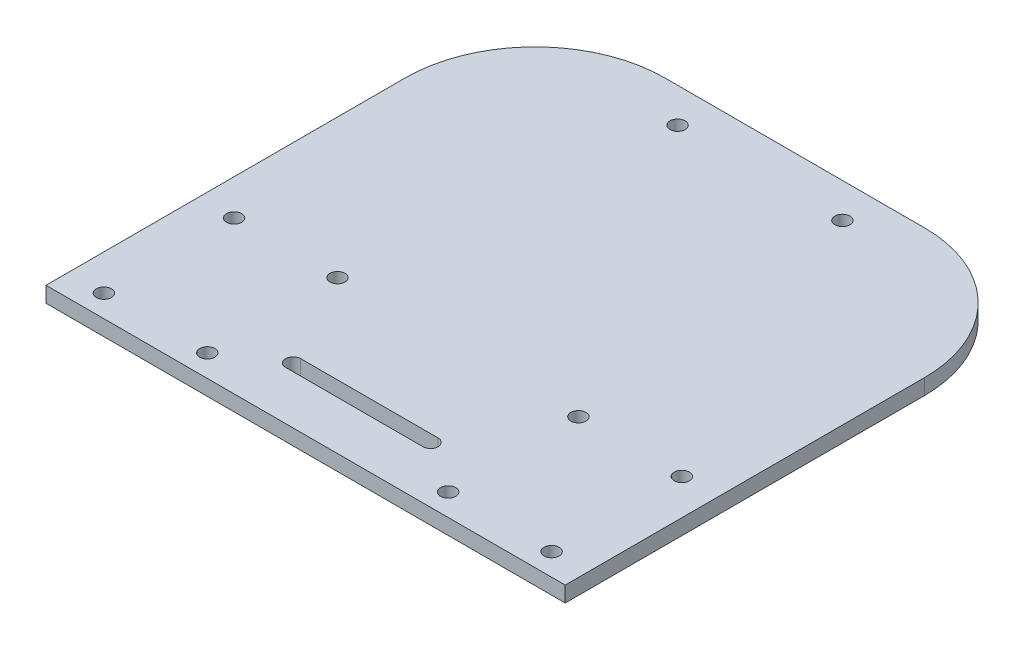
ISO-10303-21;
HEADER;
FILE_DESCRIPTION(('STEP AP214'),'2;1');
FILE_NAME('part.step','',(''),(''),'','','');
FILE_SCHEMA(('AUTOMOTIVE_DESIGN { 1 0 10303 214 1 1 1 1 }'));
ENDSEC;
DATA;
#1=APPLICATION_CONTEXT('core data for automotive mechanical design processes');
#2=APPLICATION_PROTOCOL_DEFINITION('international standard','automotive_design',2000,#1);
#3=PRODUCT_CONTEXT('',#1,'mechanical');
#4=PRODUCT('Part','Part','',(#3));
#5=PRODUCT_RELATED_PRODUCT_CATEGORY('part','',(#4));
#6=PRODUCT_DEFINITION_FORMATION('','',#4);
#7=PRODUCT_DEFINITION_CONTEXT('part definition',#1,'design');
#8=PRODUCT_DEFINITION('design','',#6,#7);
#9=PRODUCT_DEFINITION_SHAPE('','',#8);
#10=(LENGTH_UNIT() NAMED_UNIT(*) SI_UNIT(.MILLI.,.METRE.));
#11=(NAMED_UNIT(*) PLANE_ANGLE_UNIT() SI_UNIT($,.RADIAN.));
#12=(NAMED_UNIT(*) SI_UNIT($,.STERADIAN.) SOLID_ANGLE_UNIT());
#13=UNCERTAINTY_MEASURE_WITH_UNIT(LENGTH_MEASURE(1.E-05),#10,'distance_accuracy_value','');
#14=(GEOMETRIC_REPRESENTATION_CONTEXT(3) GLOBAL_UNCERTAINTY_ASSIGNED_CONTEXT((#13)) GLOBAL_UNIT_ASSIGNED_CONTEXT((#10,
#11,#12)) REPRESENTATION_CONTEXT('',''));
#15=CARTESIAN_POINT('',(0.,0.,0.));
#16=DIRECTION('',(0.,0.,1.));
#17=DIRECTION('',(1.,0.,0.));
#18=AXIS2_PLACEMENT_3D('',#15,#16,#17);
#19=CARTESIAN_POINT('',(125.000000000001,3.6,-110.));
#20=DIRECTION('',(0.,-1.,0.));
#21=DIRECTION('',(0.,0.,-1.));
#22=AXIS2_PLACEMENT_3D('',#19,#20,#21);
#23=CYLINDRICAL_SURFACE('',#22,30.);
#24=DIRECTION('',(0.,-1.,0.));
#25=VECTOR('',#24,1.);
#26=CARTESIAN_POINT('',(125.000000000001,3.6,-140.));
#27=LINE('',#26,#25);
#28=CARTESIAN_POINT('',(125.000000000001,3.6,-140.));
#29=VERTEX_POINT('',#28);
#30=CARTESIAN_POINT('',(125.000000000001,0.,-140.));
#31=VERTEX_POINT('',#30);
#32=EDGE_CURVE('E245',#29,#31,#27,.T.);
#33=ORIENTED_EDGE('',*,*,#32,.F.);
#34=CARTESIAN_POINT('',(125.000000000001,3.6,-110.));
#35=DIRECTION('',(0.,1.,0.));
#36=DIRECTION('',(0.,0.,1.));
#37=AXIS2_PLACEMENT_3D('',#34,#35,#36);
#38=CIRCLE('',#37,30.);
#39=CARTESIAN_POINT('',(155.000000000001,3.6,-110.000000000001));
#40=VERTEX_POINT('',#39);
#41=EDGE_CURVE('E42',#40,#29,#38,.T.);
#42=ORIENTED_EDGE('',*,*,#41,.F.);
#43=DIRECTION('',(0.,-1.,0.));
#44=VECTOR('',#43,1.);
#45=CARTESIAN_POINT('',(155.000000000001,3.6,-110.000000000001));
#46=LINE('',#45,#44);
#47=CARTESIAN_POINT('',(155.000000000001,0.,-110.000000000001));
#48=VERTEX_POINT('',#47);
#49=EDGE_CURVE('E248',#48,#40,#46,.F.);
#50=ORIENTED_EDGE('',*,*,#49,.F.);
#51=CARTESIAN_POINT('',(125.000000000001,0.,-110.));
#52=DIRECTION('',(0.,1.,0.));
#53=DIRECTION('',(0.,0.,1.));
#54=AXIS2_PLACEMENT_3D('',#51,#52,#53);
#55=CIRCLE('',#54,30.);
#56=EDGE_CURVE('E11',#31,#48,#55,.F.);
#57=ORIENTED_EDGE('',*,*,#56,.F.);
#58=EDGE_LOOP('',(#33,#42,#50,#57));
#59=FACE_BOUND('',#58,.T.);
#60=ADVANCED_FACE('F35',(#59),#23,.T.);
#61=CARTESIAN_POINT('',(65.0000000000009,3.6,-110.));
#62=DIRECTION('',(0.,1.,0.));
#63=DIRECTION('',(0.,0.,1.));
#64=AXIS2_PLACEMENT_3D('',#61,#62,#63);
#65=CYLINDRICAL_SURFACE('',#64,30.);
#66=DIRECTION('',(0.,-1.,0.));
#67=VECTOR('',#66,1.);
#68=CARTESIAN_POINT('',(35.0000000000009,3.6,-109.999999999999));
#69=LINE('',#68,#67);
#70=CARTESIAN_POINT('',(35.0000000000009,3.6,-109.999999999999));
#71=VERTEX_POINT('',#70);
#72=CARTESIAN_POINT('',(35.0000000000009,0.,-109.999999999999));
#73=VERTEX_POINT('',#72);
#74=EDGE_CURVE('E231',#71,#73,#69,.T.);
#75=ORIENTED_EDGE('',*,*,#74,.F.);
#76=CARTESIAN_POINT('',(65.0000000000009,3.6,-110.));
#77=DIRECTION('',(0.,1.,0.));
#78=DIRECTION('',(0.,0.,1.));
#79=AXIS2_PLACEMENT_3D('',#76,#77,#78);
#80=CIRCLE('',#79,30.);
#81=CARTESIAN_POINT('',(65.0000000000009,3.6,-140.));
#82=VERTEX_POINT('',#81);
#83=EDGE_CURVE('E241',#82,#71,#80,.T.);
#84=ORIENTED_EDGE('',*,*,#83,.F.);
#85=DIRECTION('',(0.,-1.,0.));
#86=VECTOR('',#85,1.);
#87=CARTESIAN_POINT('',(65.0000000000009,3.6,-140.));
#88=LINE('',#87,#86);
#89=CARTESIAN_POINT('',(65.0000000000009,0.,-140.));
#90=VERTEX_POINT('',#89);
#91=EDGE_CURVE('E238',#90,#82,#88,.F.);
#92=ORIENTED_EDGE('',*,*,#91,.F.);
#93=CARTESIAN_POINT('',(65.0000000000009,0.,-110.));
#94=DIRECTION('',(0.,1.,0.));
#95=DIRECTION('',(0.,0.,1.));
#96=AXIS2_PLACEMENT_3D('',#93,#94,#95);
#97=CIRCLE('',#96,30.);
#98=EDGE_CURVE('E243',#73,#90,#97,.F.);
#99=ORIENTED_EDGE('',*,*,#98,.F.);
#100=EDGE_LOOP('',(#75,#84,#92,#99));
#101=FACE_BOUND('',#100,.T.);
#102=ADVANCED_FACE('F258',(#101),#65,.T.);
#103=CARTESIAN_POINT('',(35.0000000000043,3.6,-1.07444342852169E-12));
#104=DIRECTION('',(1.,0.,0.));
#105=DIRECTION('',(0.,0.,-1.));
#106=AXIS2_PLACEMENT_3D('',#103,#104,#105);
#107=PLANE('',#106);
#108=DIRECTION('',(0.,0.,1.));
#109=VECTOR('',#108,1.);
#110=CARTESIAN_POINT('',(35.0000000000043,3.6,-1.07444342852169E-12));
#111=LINE('',#110,#109);
#112=CARTESIAN_POINT('',(35.0000000000034,3.6,-26.9827483746946));
#113=VERTEX_POINT('',#112);
#114=EDGE_CURVE('E140',#71,#113,#111,.T.);
#115=ORIENTED_EDGE('',*,*,#114,.F.);
#116=ORIENTED_EDGE('',*,*,#74,.T.);
#117=DIRECTION('',(0.,0.,1.));
#118=VECTOR('',#117,1.);
#119=CARTESIAN_POINT('',(35.0000000000043,0.,-1.07444342852169E-12));
#120=LINE('',#119,#118);
#121=CARTESIAN_POINT('',(35.0000000000034,0.,-26.9827483746946));
#122=VERTEX_POINT('',#121);
#123=EDGE_CURVE('E190',#73,#122,#120,.T.);
#124=ORIENTED_EDGE('',*,*,#123,.T.);
#125=DIRECTION('',(0.,-1.,0.));
#126=VECTOR('',#125,1.);
#127=CARTESIAN_POINT('',(35.0000000000034,3.6,-26.9827483746946));
#128=LINE('',#127,#126);
#129=EDGE_CURVE('E228',#113,#122,#128,.T.);
#130=ORIENTED_EDGE('',*,*,#129,.F.);
#131=EDGE_LOOP('',(#115,#116,#124,#130));
#132=FACE_BOUND('',#131,.T.);
#133=ADVANCED_FACE('F266',(#132),#107,.F.);
#134=CARTESIAN_POINT('',(0.,3.6,-26.9827483746946));
#135=DIRECTION('',(0.,0.,-1.));
#136=DIRECTION('',(-1.,0.,0.));
#137=AXIS2_PLACEMENT_3D('',#134,#135,#136);
#138=PLANE('',#137);
#139=DIRECTION('',(1.,0.,0.));
#140=VECTOR('',#139,1.);
#141=CARTESIAN_POINT('',(0.,0.,-26.9827483746946));
#142=LINE('',#141,#140);
#143=CARTESIAN_POINT('',(155.000000000003,0.,-26.9827483746946));
#144=VERTEX_POINT('',#143);
#145=EDGE_CURVE('E192',#122,#144,#142,.T.);
#146=ORIENTED_EDGE('',*,*,#145,.T.);
#147=DIRECTION('',(0.,-1.,0.));
#148=VECTOR('',#147,1.);
#149=CARTESIAN_POINT('',(155.000000000003,3.6,-26.9827483746946));
#150=LINE('',#149,#148);
#151=CARTESIAN_POINT('',(155.000000000003,3.6,-26.9827483746946));
#152=VERTEX_POINT('',#151);
#153=EDGE_CURVE('E118',#152,#144,#150,.T.);
#154=ORIENTED_EDGE('',*,*,#153,.F.);
#155=DIRECTION('',(1.,0.,0.));
#156=VECTOR('',#155,1.);
#157=CARTESIAN_POINT('',(0.,3.6,-26.9827483746946));
#158=LINE('',#157,#156);
#159=EDGE_CURVE('E142',#113,#152,#158,.T.);
#160=ORIENTED_EDGE('',*,*,#159,.F.);
#161=ORIENTED_EDGE('',*,*,#129,.T.);
#162=EDGE_LOOP('',(#146,#154,#160,#161));
#163=FACE_BOUND('',#162,.T.);
#164=ADVANCED_FACE('F265',(#163),#138,.F.);
#165=CARTESIAN_POINT('',(155.000000000004,3.6,-4.79631546492035E-12));
#166=DIRECTION('',(1.,0.,0.));
#167=DIRECTION('',(0.,0.,-1.));
#168=AXIS2_PLACEMENT_3D('',#165,#166,#167);
#169=PLANE('',#168);
#170=DIRECTION('',(0.,0.,1.));
#171=VECTOR('',#170,1.);
#172=CARTESIAN_POINT('',(155.000000000004,0.,-4.79631546492035E-12));
#173=LINE('',#172,#171);
#174=EDGE_CURVE('E195',#48,#144,#173,.T.);
#175=ORIENTED_EDGE('',*,*,#174,.F.);
#176=ORIENTED_EDGE('',*,*,#49,.T.);
#177=DIRECTION('',(0.,0.,1.));
#178=VECTOR('',#177,1.);
#179=CARTESIAN_POINT('',(155.000000000004,3.6,-4.79631546492035E-12));
#180=LINE('',#179,#178);
#181=EDGE_CURVE('E145',#40,#152,#180,.T.);
#182=ORIENTED_EDGE('',*,*,#181,.T.);
#183=ORIENTED_EDGE('',*,*,#153,.T.);
#184=EDGE_LOOP('',(#175,#176,#182,#183));
#185=FACE_BOUND('',#184,.T.);
#186=ADVANCED_FACE('F273',(#185),#169,.T.);
#187=CARTESIAN_POINT('',(110.877455899999,3.6,-39.9827483746946));
#188=DIRECTION('',(0.,-1.,0.));
#189=DIRECTION('',(0.,0.,-1.));
#190=AXIS2_PLACEMENT_3D('',#187,#188,#189);
#191=CYLINDRICAL_SURFACE('',#190,1.75);
#192=CARTESIAN_POINT('',(110.877455899999,0.,-39.9827483746946));
#193=DIRECTION('',(0.,1.,0.));
#194=DIRECTION('',(0.,0.,1.));
#195=AXIS2_PLACEMENT_3D('',#192,#193,#194);
#196=CIRCLE('',#195,1.75);
#197=CARTESIAN_POINT('',(110.877455899999,0.,-38.2327483746946));
#198=VERTEX_POINT('',#197);
#199=CARTESIAN_POINT('',(110.877455899999,0.,-41.7327483746946));
#200=VERTEX_POINT('',#199);
#201=EDGE_CURVE('E113',#198,#200,#196,.T.);
#202=ORIENTED_EDGE('',*,*,#201,.F.);
#203=DIRECTION('',(0.,-1.,0.));
#204=VECTOR('',#203,1.);
#205=CARTESIAN_POINT('',(110.877455899999,3.6,-38.2327483746946));
#206=LINE('',#205,#204);
#207=CARTESIAN_POINT('',(110.877455899999,3.6,-38.2327483746946));
#208=VERTEX_POINT('',#207);
#209=EDGE_CURVE('E108',#208,#198,#206,.T.);
#210=ORIENTED_EDGE('',*,*,#209,.F.);
#211=CARTESIAN_POINT('',(110.877455899999,3.6,-39.9827483746946));
#212=DIRECTION('',(0.,1.,0.));
#213=DIRECTION('',(0.,0.,1.));
#214=AXIS2_PLACEMENT_3D('',#211,#212,#213);
#215=CIRCLE('',#214,1.75);
#216=CARTESIAN_POINT('',(110.877455899999,3.6,-41.7327483746946));
#217=VERTEX_POINT('',#216);
#218=EDGE_CURVE('E111',#208,#217,#215,.T.);
#219=ORIENTED_EDGE('',*,*,#218,.T.);
#220=DIRECTION('',(0.,-1.,0.));
#221=VECTOR('',#220,1.);
#222=CARTESIAN_POINT('',(110.877455899999,3.6,-41.7327483746946));
#223=LINE('',#222,#221);
#224=EDGE_CURVE('E177',#217,#200,#223,.T.);
#225=ORIENTED_EDGE('',*,*,#224,.T.);
#226=EDGE_LOOP('',(#202,#210,#219,#225));
#227=FACE_BOUND('',#226,.T.);
#228=ADVANCED_FACE('F110',(#227),#191,.F.);
#229=CARTESIAN_POINT('',(0.,3.6,-38.2327483746945));
#230=DIRECTION('',(0.,0.,-1.));
#231=DIRECTION('',(-1.,0.,0.));
#232=AXIS2_PLACEMENT_3D('',#229,#230,#231);
#233=PLANE('',#232);
#234=DIRECTION('',(1.,0.,0.));
#235=VECTOR('',#234,1.);
#236=CARTESIAN_POINT('',(0.,0.,-38.2327483746945));
#237=LINE('',#236,#235);
#238=CARTESIAN_POINT('',(79.1225441000007,0.,-38.2327483746946));
#239=VERTEX_POINT('',#238);
#240=EDGE_CURVE('E182',#239,#198,#237,.T.);
#241=ORIENTED_EDGE('',*,*,#240,.F.);
#242=DIRECTION('',(0.,-1.,0.));
#243=VECTOR('',#242,1.);
#244=CARTESIAN_POINT('',(79.1225441000007,3.6,-38.2327483746946));
#245=LINE('',#244,#243);
#246=CARTESIAN_POINT('',(79.1225441000007,3.6,-38.2327483746946));
#247=VERTEX_POINT('',#246);
#248=EDGE_CURVE('E119',#247,#239,#245,.T.);
#249=ORIENTED_EDGE('',*,*,#248,.F.);
#250=DIRECTION('',(1.,0.,0.));
#251=VECTOR('',#250,1.);
#252=CARTESIAN_POINT('',(0.,3.6,-38.2327483746945));
#253=LINE('',#252,#251);
#254=EDGE_CURVE('E126',#247,#208,#253,.T.);
#255=ORIENTED_EDGE('',*,*,#254,.T.);
#256=ORIENTED_EDGE('',*,*,#209,.T.);
#257=EDGE_LOOP('',(#241,#249,#255,#256));
#258=FACE_BOUND('',#257,.T.);
#259=ADVANCED_FACE('F133',(#258),#233,.T.);
#260=CARTESIAN_POINT('',(79.1225441000007,3.6,-39.9827483746946));
#261=DIRECTION('',(0.,-1.,0.));
#262=DIRECTION('',(0.,0.,-1.));
#263=AXIS2_PLACEMENT_3D('',#260,#261,#262);
#264=CYLINDRICAL_SURFACE('',#263,1.75);
#265=CARTESIAN_POINT('',(79.1225441000007,0.,-39.9827483746946));
#266=DIRECTION('',(0.,1.,0.));
#267=DIRECTION('',(0.,0.,1.));
#268=AXIS2_PLACEMENT_3D('',#265,#266,#267);
#269=CIRCLE('',#268,1.75);
#270=CARTESIAN_POINT('',(79.1225441000007,0.,-41.7327483746946));
#271=VERTEX_POINT('',#270);
#272=EDGE_CURVE('E184',#271,#239,#269,.T.);
#273=ORIENTED_EDGE('',*,*,#272,.F.);
#274=DIRECTION('',(0.,-1.,0.));
#275=VECTOR('',#274,1.);
#276=CARTESIAN_POINT('',(79.1225441000007,3.6,-41.7327483746946));
#277=LINE('',#276,#275);
#278=CARTESIAN_POINT('',(79.1225441000007,3.6,-41.7327483746946));
#279=VERTEX_POINT('',#278);
#280=EDGE_CURVE('E233',#279,#271,#277,.T.);
#281=ORIENTED_EDGE('',*,*,#280,.F.);
#282=CARTESIAN_POINT('',(79.1225441000007,3.6,-39.9827483746946));
#283=DIRECTION('',(0.,1.,0.));
#284=DIRECTION('',(0.,0.,1.));
#285=AXIS2_PLACEMENT_3D('',#282,#283,#284);
#286=CIRCLE('',#285,1.75);
#287=EDGE_CURVE('E134',#279,#247,#286,.T.);
#288=ORIENTED_EDGE('',*,*,#287,.T.);
#289=ORIENTED_EDGE('',*,*,#248,.T.);
#290=EDGE_LOOP('',(#273,#281,#288,#289));
#291=FACE_BOUND('',#290,.T.);
#292=ADVANCED_FACE('F300',(#291),#264,.F.);
#293=CARTESIAN_POINT('',(67.1630650365044,3.6,-62.1932949656054));
#294=DIRECTION('',(0.,-1.,0.));
#295=DIRECTION('',(0.,0.,-1.));
#296=AXIS2_PLACEMENT_3D('',#293,#294,#295);
#297=CYLINDRICAL_SURFACE('',#296,1.75);
#298=CARTESIAN_POINT('',(67.1630650365044,3.6,-62.1932949656054));
#299=DIRECTION('',(0.,1.,0.));
#300=DIRECTION('',(0.,0.,1.));
#301=AXIS2_PLACEMENT_3D('',#298,#299,#300);
#302=CIRCLE('',#301,1.75);
#303=CARTESIAN_POINT('',(67.1630650365044,3.6,-60.4432949656054));
#304=VERTEX_POINT('',#303);
#305=EDGE_CURVE('E171',#304,#304,#302,.T.);
#306=ORIENTED_EDGE('',*,*,#305,.T.);
#307=EDGE_LOOP('',(#306));
#308=FACE_BOUND('',#307,.T.);
#309=CARTESIAN_POINT('',(67.1630650365044,0.,-62.1932949656054));
#310=DIRECTION('',(0.,1.,0.));
#311=DIRECTION('',(0.,0.,1.));
#312=AXIS2_PLACEMENT_3D('',#309,#310,#311);
#313=CIRCLE('',#312,1.75);
#314=CARTESIAN_POINT('',(67.1630650365044,0.,-60.4432949656054));
#315=VERTEX_POINT('',#314);
#316=EDGE_CURVE('E220',#315,#315,#313,.T.);
#317=ORIENTED_EDGE('',*,*,#316,.F.);
#318=EDGE_LOOP('',(#317));
#319=FACE_BOUND('',#318,.T.);
#320=ADVANCED_FACE('F303',(#308,#319),#297,.F.);
#321=CARTESIAN_POINT('',(43.2630650365112,3.6,-62.1932949656054));
#322=DIRECTION('',(0.,-1.,0.));
#323=DIRECTION('',(0.,0.,-1.));
#324=AXIS2_PLACEMENT_3D('',#321,#322,#323);
#325=CYLINDRICAL_SURFACE('',#324,1.75);
#326=CARTESIAN_POINT('',(43.2630650365112,3.6,-62.1932949656054));
#327=DIRECTION('',(0.,1.,0.));
#328=DIRECTION('',(0.,0.,1.));
#329=AXIS2_PLACEMENT_3D('',#326,#327,#328);
#330=CIRCLE('',#329,1.75);
#331=CARTESIAN_POINT('',(43.2630650365112,3.6,-60.4432949656054));
#332=VERTEX_POINT('',#331);
#333=EDGE_CURVE('E168',#332,#332,#330,.T.);
#334=ORIENTED_EDGE('',*,*,#333,.T.);
#335=EDGE_LOOP('',(#334));
#336=FACE_BOUND('',#335,.T.);
#337=CARTESIAN_POINT('',(43.2630650365112,0.,-62.1932949656054));
#338=DIRECTION('',(0.,1.,0.));
#339=DIRECTION('',(0.,0.,1.));
#340=AXIS2_PLACEMENT_3D('',#337,#338,#339);
#341=CIRCLE('',#340,1.75);
#342=CARTESIAN_POINT('',(43.2630650365112,0.,-60.4432949656054));
#343=VERTEX_POINT('',#342);
#344=EDGE_CURVE('E217',#343,#343,#341,.T.);
#345=ORIENTED_EDGE('',*,*,#344,.F.);
#346=EDGE_LOOP('',(#345));
#347=FACE_BOUND('',#346,.T.);
#348=ADVANCED_FACE('F329',(#336,#347),#325,.F.);
#349=CARTESIAN_POINT('',(67.1630650365044,3.6,-32.0932949656049));
#350=DIRECTION('',(0.,-1.,0.));
#351=DIRECTION('',(0.,0.,-1.));
#352=AXIS2_PLACEMENT_3D('',#349,#350,#351);
#353=CYLINDRICAL_SURFACE('',#352,1.75);
#354=CARTESIAN_POINT('',(67.1630650365044,3.6,-32.0932949656049));
#355=DIRECTION('',(0.,1.,0.));
#356=DIRECTION('',(0.,0.,1.));
#357=AXIS2_PLACEMENT_3D('',#354,#355,#356);
#358=CIRCLE('',#357,1.75);
#359=CARTESIAN_POINT('',(67.1630650365044,3.6,-30.3432949656049));
#360=VERTEX_POINT('',#359);
#361=EDGE_CURVE('E165',#360,#360,#358,.F.);
#362=ORIENTED_EDGE('',*,*,#361,.F.);
#363=EDGE_LOOP('',(#362));
#364=FACE_BOUND('',#363,.T.);
#365=CARTESIAN_POINT('',(67.1630650365044,0.,-32.0932949656049));
#366=DIRECTION('',(0.,1.,0.));
#367=DIRECTION('',(0.,0.,1.));
#368=AXIS2_PLACEMENT_3D('',#365,#366,#367);
#369=CIRCLE('',#368,1.75);
#370=CARTESIAN_POINT('',(67.1630650365044,0.,-30.3432949656049));
#371=VERTEX_POINT('',#370);
#372=EDGE_CURVE('E214',#371,#371,#369,.F.);
#373=ORIENTED_EDGE('',*,*,#372,.T.);
#374=EDGE_LOOP('',(#373));
#375=FACE_BOUND('',#374,.T.);
#376=ADVANCED_FACE('F333',(#364,#375),#353,.F.);
#377=CARTESIAN_POINT('',(122.836934963496,3.6,-62.1932949656056));
#378=DIRECTION('',(0.,-1.,0.));
#379=DIRECTION('',(0.,0.,-1.));
#380=AXIS2_PLACEMENT_3D('',#377,#378,#379);
#381=CYLINDRICAL_SURFACE('',#380,1.75000000000001);
#382=CARTESIAN_POINT('',(122.836934963496,3.6,-62.1932949656056));
#383=DIRECTION('',(0.,1.,0.));
#384=DIRECTION('',(0.,0.,1.));
#385=AXIS2_PLACEMENT_3D('',#382,#383,#384);
#386=CIRCLE('',#385,1.75000000000001);
#387=CARTESIAN_POINT('',(122.836934963496,3.6,-60.4432949656056));
#388=VERTEX_POINT('',#387);
#389=EDGE_CURVE('E162',#388,#388,#386,.F.);
#390=ORIENTED_EDGE('',*,*,#389,.F.);
#391=EDGE_LOOP('',(#390));
#392=FACE_BOUND('',#391,.T.);
#393=CARTESIAN_POINT('',(122.836934963496,0.,-62.1932949656056));
#394=DIRECTION('',(0.,1.,0.));
#395=DIRECTION('',(0.,0.,1.));
#396=AXIS2_PLACEMENT_3D('',#393,#394,#395);
#397=CIRCLE('',#396,1.75000000000001);
#398=CARTESIAN_POINT('',(122.836934963496,0.,-60.4432949656056));
#399=VERTEX_POINT('',#398);
#400=EDGE_CURVE('E211',#399,#399,#397,.F.);
#401=ORIENTED_EDGE('',*,*,#400,.T.);
#402=EDGE_LOOP('',(#401));
#403=FACE_BOUND('',#402,.T.);
#404=ADVANCED_FACE('F337',(#392,#403),#381,.F.);
#405=CARTESIAN_POINT('',(122.836934963496,3.6,-32.0932949656051));
#406=DIRECTION('',(0.,-1.,0.));
#407=DIRECTION('',(0.,0.,-1.));
#408=AXIS2_PLACEMENT_3D('',#405,#406,#407);
#409=CYLINDRICAL_SURFACE('',#408,1.74999999999998);
#410=CARTESIAN_POINT('',(122.836934963496,3.6,-32.0932949656051));
#411=DIRECTION('',(0.,1.,0.));
#412=DIRECTION('',(0.,0.,1.));
#413=AXIS2_PLACEMENT_3D('',#410,#411,#412);
#414=CIRCLE('',#413,1.74999999999998);
#415=CARTESIAN_POINT('',(122.836934963496,3.6,-30.3432949656051));
#416=VERTEX_POINT('',#415);
#417=EDGE_CURVE('E159',#416,#416,#414,.T.);
#418=ORIENTED_EDGE('',*,*,#417,.T.);
#419=EDGE_LOOP('',(#418));
#420=FACE_BOUND('',#419,.T.);
#421=CARTESIAN_POINT('',(122.836934963496,0.,-32.0932949656051));
#422=DIRECTION('',(0.,1.,0.));
#423=DIRECTION('',(0.,0.,1.));
#424=AXIS2_PLACEMENT_3D('',#421,#422,#423);
#425=CIRCLE('',#424,1.74999999999998);
#426=CARTESIAN_POINT('',(122.836934963496,0.,-30.3432949656051));
#427=VERTEX_POINT('',#426);
#428=EDGE_CURVE('E208',#427,#427,#425,.T.);
#429=ORIENTED_EDGE('',*,*,#428,.F.);
#430=EDGE_LOOP('',(#429));
#431=FACE_BOUND('',#430,.T.);
#432=ADVANCED_FACE('F341',(#420,#431),#409,.F.);
#433=CARTESIAN_POINT('',(146.736934963496,3.6,-32.0932949656055));
#434=DIRECTION('',(0.,-1.,0.));
#435=DIRECTION('',(0.,0.,-1.));
#436=AXIS2_PLACEMENT_3D('',#433,#434,#435);
#437=CYLINDRICAL_SURFACE('',#436,1.75000000000001);
#438=CARTESIAN_POINT('',(146.736934963496,3.6,-32.0932949656055));
#439=DIRECTION('',(0.,1.,0.));
#440=DIRECTION('',(0.,0.,1.));
#441=AXIS2_PLACEMENT_3D('',#438,#439,#440);
#442=CIRCLE('',#441,1.75000000000001);
#443=CARTESIAN_POINT('',(146.736934963496,3.6,-30.3432949656054));
#444=VERTEX_POINT('',#443);
#445=EDGE_CURVE('E156',#444,#444,#442,.T.);
#446=ORIENTED_EDGE('',*,*,#445,.T.);
#447=EDGE_LOOP('',(#446));
#448=FACE_BOUND('',#447,.T.);
#449=CARTESIAN_POINT('',(146.736934963496,0.,-32.0932949656055));
#450=DIRECTION('',(0.,1.,0.));
#451=DIRECTION('',(0.,0.,1.));
#452=AXIS2_PLACEMENT_3D('',#449,#450,#451);
#453=CIRCLE('',#452,1.75000000000001);
#454=CARTESIAN_POINT('',(146.736934963496,0.,-30.3432949656054));
#455=VERTEX_POINT('',#454);
#456=EDGE_CURVE('E205',#455,#455,#453,.T.);
#457=ORIENTED_EDGE('',*,*,#456,.F.);
#458=EDGE_LOOP('',(#457));
#459=FACE_BOUND('',#458,.T.);
#460=ADVANCED_FACE('F345',(#448,#459),#437,.F.);
#461=CARTESIAN_POINT('',(146.736934963489,3.6,-62.1932949656058));
#462=DIRECTION('',(0.,-1.,0.));
#463=DIRECTION('',(0.,0.,-1.));
#464=AXIS2_PLACEMENT_3D('',#461,#462,#463);
#465=CYLINDRICAL_SURFACE('',#464,1.74999999999998);
#466=CARTESIAN_POINT('',(146.736934963489,3.6,-62.1932949656058));
#467=DIRECTION('',(0.,1.,0.));
#468=DIRECTION('',(0.,0.,1.));
#469=AXIS2_PLACEMENT_3D('',#466,#467,#468);
#470=CIRCLE('',#469,1.74999999999998);
#471=CARTESIAN_POINT('',(146.736934963489,3.6,-60.4432949656059));
#472=VERTEX_POINT('',#471);
#473=EDGE_CURVE('E153',#472,#472,#470,.F.);
#474=ORIENTED_EDGE('',*,*,#473,.F.);
#475=EDGE_LOOP('',(#474));
#476=FACE_BOUND('',#475,.T.);
#477=CARTESIAN_POINT('',(146.736934963489,0.,-62.1932949656058));
#478=DIRECTION('',(0.,1.,0.));
#479=DIRECTION('',(0.,0.,1.));
#480=AXIS2_PLACEMENT_3D('',#477,#478,#479);
#481=CIRCLE('',#480,1.74999999999998);
#482=CARTESIAN_POINT('',(146.736934963489,0.,-60.4432949656059));
#483=VERTEX_POINT('',#482);
#484=EDGE_CURVE('E202',#483,#483,#481,.F.);
#485=ORIENTED_EDGE('',*,*,#484,.T.);
#486=EDGE_LOOP('',(#485));
#487=FACE_BOUND('',#486,.T.);
#488=ADVANCED_FACE('F349',(#476,#487),#465,.F.);
#489=CARTESIAN_POINT('',(75.9500000000001,3.6,-132.));
#490=DIRECTION('',(0.,-1.,0.));
#491=DIRECTION('',(0.,0.,-1.));
#492=AXIS2_PLACEMENT_3D('',#489,#490,#491);
#493=CYLINDRICAL_SURFACE('',#492,1.75);
#494=CARTESIAN_POINT('',(75.9500000000001,3.6,-132.));
#495=DIRECTION('',(0.,1.,0.));
#496=DIRECTION('',(0.,0.,1.));
#497=AXIS2_PLACEMENT_3D('',#494,#495,#496);
#498=CIRCLE('',#497,1.75);
#499=CARTESIAN_POINT('',(75.9500000000001,3.6,-130.25));
#500=VERTEX_POINT('',#499);
#501=EDGE_CURVE('E150',#500,#500,#498,.T.);
#502=ORIENTED_EDGE('',*,*,#501,.T.);
#503=EDGE_LOOP('',(#502));
#504=FACE_BOUND('',#503,.T.);
#505=CARTESIAN_POINT('',(75.9500000000001,0.,-132.));
#506=DIRECTION('',(0.,1.,0.));
#507=DIRECTION('',(0.,0.,1.));
#508=AXIS2_PLACEMENT_3D('',#505,#506,#507);
#509=CIRCLE('',#508,1.75);
#510=CARTESIAN_POINT('',(75.9500000000001,0.,-130.25));
#511=VERTEX_POINT('',#510);
#512=EDGE_CURVE('E199',#511,#511,#509,.T.);
#513=ORIENTED_EDGE('',*,*,#512,.F.);
#514=EDGE_LOOP('',(#513));
#515=FACE_BOUND('',#514,.T.);
#516=ADVANCED_FACE('F310',(#504,#515),#493,.F.);
#517=CARTESIAN_POINT('',(0.,3.6,-140.));
#518=DIRECTION('',(0.,0.,-1.));
#519=DIRECTION('',(-1.,0.,0.));
#520=AXIS2_PLACEMENT_3D('',#517,#518,#519);
#521=PLANE('',#520);
#522=DIRECTION('',(1.,0.,0.));
#523=VECTOR('',#522,1.);
#524=CARTESIAN_POINT('',(0.,3.6,-140.));
#525=LINE('',#524,#523);
#526=EDGE_CURVE('E147',#82,#29,#525,.T.);
#527=ORIENTED_EDGE('',*,*,#526,.T.);
#528=ORIENTED_EDGE('',*,*,#32,.T.);
#529=DIRECTION('',(1.,0.,0.));
#530=VECTOR('',#529,1.);
#531=CARTESIAN_POINT('',(0.,0.,-140.));
#532=LINE('',#531,#530);
#533=EDGE_CURVE('E197',#90,#31,#532,.T.);
#534=ORIENTED_EDGE('',*,*,#533,.F.);
#535=ORIENTED_EDGE('',*,*,#91,.T.);
#536=EDGE_LOOP('',(#527,#528,#534,#535));
#537=FACE_BOUND('',#536,.T.);
#538=ADVANCED_FACE('F254',(#537),#521,.T.);
#539=CARTESIAN_POINT('',(0.,3.6,-41.7327483746945));
#540=DIRECTION('',(0.,0.,-1.));
#541=DIRECTION('',(-1.,0.,0.));
#542=AXIS2_PLACEMENT_3D('',#539,#540,#541);
#543=PLANE('',#542);
#544=DIRECTION('',(1.,0.,0.));
#545=VECTOR('',#544,1.);
#546=CARTESIAN_POINT('',(0.,0.,-41.7327483746945));
#547=LINE('',#546,#545);
#548=EDGE_CURVE('E187',#271,#200,#547,.T.);
#549=ORIENTED_EDGE('',*,*,#548,.T.);
#550=ORIENTED_EDGE('',*,*,#224,.F.);
#551=DIRECTION('',(1.,0.,0.));
#552=VECTOR('',#551,1.);
#553=CARTESIAN_POINT('',(0.,3.6,-41.7327483746945));
#554=LINE('',#553,#552);
#555=EDGE_CURVE('E129',#279,#217,#554,.T.);
#556=ORIENTED_EDGE('',*,*,#555,.F.);
#557=ORIENTED_EDGE('',*,*,#280,.T.);
#558=EDGE_LOOP('',(#549,#550,#556,#557));
#559=FACE_BOUND('',#558,.T.);
#560=ADVANCED_FACE('F295',(#559),#543,.F.);
#561=CARTESIAN_POINT('',(114.05,3.6,-132.));
#562=DIRECTION('',(0.,-1.,0.));
#563=DIRECTION('',(0.,0.,-1.));
#564=AXIS2_PLACEMENT_3D('',#561,#562,#563);
#565=CYLINDRICAL_SURFACE('',#564,1.75);
#566=CARTESIAN_POINT('',(114.05,3.6,-132.));
#567=DIRECTION('',(0.,1.,0.));
#568=DIRECTION('',(0.,0.,1.));
#569=AXIS2_PLACEMENT_3D('',#566,#567,#568);
#570=CIRCLE('',#569,1.75);
#571=CARTESIAN_POINT('',(114.05,3.6,-130.25));
#572=VERTEX_POINT('',#571);
#573=EDGE_CURVE('E131',#572,#572,#570,.F.);
#574=ORIENTED_EDGE('',*,*,#573,.F.);
#575=EDGE_LOOP('',(#574));
#576=FACE_BOUND('',#575,.T.);
#577=CARTESIAN_POINT('',(114.05,0.,-132.));
#578=DIRECTION('',(0.,1.,0.));
#579=DIRECTION('',(0.,0.,1.));
#580=AXIS2_PLACEMENT_3D('',#577,#578,#579);
#581=CIRCLE('',#580,1.75);
#582=CARTESIAN_POINT('',(114.05,0.,-130.25));
#583=VERTEX_POINT('',#582);
#584=EDGE_CURVE('E178',#583,#583,#581,.F.);
#585=ORIENTED_EDGE('',*,*,#584,.T.);
#586=EDGE_LOOP('',(#585));
#587=FACE_BOUND('',#586,.T.);
#588=ADVANCED_FACE('F292',(#576,#587),#565,.F.);
#589=CARTESIAN_POINT('',(43.2630650365045,3.6,-32.093294965605));
#590=DIRECTION('',(0.,-1.,0.));
#591=DIRECTION('',(0.,0.,-1.));
#592=AXIS2_PLACEMENT_3D('',#589,#590,#591);
#593=CYLINDRICAL_SURFACE('',#592,1.74999999999999);
#594=CARTESIAN_POINT('',(43.2630650365045,3.6,-32.093294965605));
#595=DIRECTION('',(0.,1.,0.));
#596=DIRECTION('',(0.,0.,1.));
#597=AXIS2_PLACEMENT_3D('',#594,#595,#596);
#598=CIRCLE('',#597,1.74999999999999);
#599=CARTESIAN_POINT('',(43.2630650365045,3.6,-30.343294965605));
#600=VERTEX_POINT('',#599);
#601=EDGE_CURVE('E174',#600,#600,#598,.F.);
#602=ORIENTED_EDGE('',*,*,#601,.F.);
#603=EDGE_LOOP('',(#602));
#604=FACE_BOUND('',#603,.T.);
#605=CARTESIAN_POINT('',(43.2630650365045,0.,-32.093294965605));
#606=DIRECTION('',(0.,1.,0.));
#607=DIRECTION('',(0.,0.,1.));
#608=AXIS2_PLACEMENT_3D('',#605,#606,#607);
#609=CIRCLE('',#608,1.74999999999999);
#610=CARTESIAN_POINT('',(43.2630650365045,0.,-30.343294965605));
#611=VERTEX_POINT('',#610);
#612=EDGE_CURVE('E223',#611,#611,#609,.F.);
#613=ORIENTED_EDGE('',*,*,#612,.T.);
#614=EDGE_LOOP('',(#613));
#615=FACE_BOUND('',#614,.T.);
#616=ADVANCED_FACE('F294',(#604,#615),#593,.F.);
#617=CARTESIAN_POINT('',(0.,3.6,0.));
#618=DIRECTION('',(0.,1.,0.));
#619=DIRECTION('',(0.,0.,1.));
#620=AXIS2_PLACEMENT_3D('',#617,#618,#619);
#621=PLANE('',#620);
#622=ORIENTED_EDGE('',*,*,#573,.T.);
#623=EDGE_LOOP('',(#622));
#624=FACE_BOUND('',#623,.T.);
#625=ORIENTED_EDGE('',*,*,#218,.F.);
#626=ORIENTED_EDGE('',*,*,#254,.F.);
#627=ORIENTED_EDGE('',*,*,#287,.F.);
#628=ORIENTED_EDGE('',*,*,#555,.T.);
#629=EDGE_LOOP('',(#625,#626,#627,#628));
#630=FACE_BOUND('',#629,.T.);
#631=ORIENTED_EDGE('',*,*,#181,.F.);
#632=ORIENTED_EDGE('',*,*,#41,.T.);
#633=ORIENTED_EDGE('',*,*,#526,.F.);
#634=ORIENTED_EDGE('',*,*,#83,.T.);
#635=ORIENTED_EDGE('',*,*,#114,.T.);
#636=ORIENTED_EDGE('',*,*,#159,.T.);
#637=EDGE_LOOP('',(#631,#632,#633,#634,#635,#636));
#638=FACE_BOUND('',#637,.T.);
#639=ORIENTED_EDGE('',*,*,#501,.F.);
#640=EDGE_LOOP('',(#639));
#641=FACE_BOUND('',#640,.T.);
#642=ORIENTED_EDGE('',*,*,#473,.T.);
#643=EDGE_LOOP('',(#642));
#644=FACE_BOUND('',#643,.T.);
#645=ORIENTED_EDGE('',*,*,#445,.F.);
#646=EDGE_LOOP('',(#645));
#647=FACE_BOUND('',#646,.T.);
#648=ORIENTED_EDGE('',*,*,#417,.F.);
#649=EDGE_LOOP('',(#648));
#650=FACE_BOUND('',#649,.T.);
#651=ORIENTED_EDGE('',*,*,#389,.T.);
#652=EDGE_LOOP('',(#651));
#653=FACE_BOUND('',#652,.T.);
#654=ORIENTED_EDGE('',*,*,#361,.T.);
#655=EDGE_LOOP('',(#654));
#656=FACE_BOUND('',#655,.T.);
#657=ORIENTED_EDGE('',*,*,#333,.F.);
#658=EDGE_LOOP('',(#657));
#659=FACE_BOUND('',#658,.T.);
#660=ORIENTED_EDGE('',*,*,#305,.F.);
#661=EDGE_LOOP('',(#660));
#662=FACE_BOUND('',#661,.T.);
#663=ORIENTED_EDGE('',*,*,#601,.T.);
#664=EDGE_LOOP('',(#663));
#665=FACE_BOUND('',#664,.T.);
#666=ADVANCED_FACE('F123',(#624,#630,#638,#641,#644,#647,#650,#653,#656,#659,#662,#665),#621,.T.);
#667=CARTESIAN_POINT('',(0.,0.,0.));
#668=DIRECTION('',(0.,1.,0.));
#669=DIRECTION('',(0.,0.,1.));
#670=AXIS2_PLACEMENT_3D('',#667,#668,#669);
#671=PLANE('',#670);
#672=ORIENTED_EDGE('',*,*,#584,.F.);
#673=EDGE_LOOP('',(#672));
#674=FACE_BOUND('',#673,.T.);
#675=ORIENTED_EDGE('',*,*,#201,.T.);
#676=ORIENTED_EDGE('',*,*,#548,.F.);
#677=ORIENTED_EDGE('',*,*,#272,.T.);
#678=ORIENTED_EDGE('',*,*,#240,.T.);
#679=EDGE_LOOP('',(#675,#676,#677,#678));
#680=FACE_BOUND('',#679,.T.);
#681=ORIENTED_EDGE('',*,*,#533,.T.);
#682=ORIENTED_EDGE('',*,*,#56,.T.);
#683=ORIENTED_EDGE('',*,*,#174,.T.);
#684=ORIENTED_EDGE('',*,*,#145,.F.);
#685=ORIENTED_EDGE('',*,*,#123,.F.);
#686=ORIENTED_EDGE('',*,*,#98,.T.);
#687=EDGE_LOOP('',(#681,#682,#683,#684,#685,#686));
#688=FACE_BOUND('',#687,.T.);
#689=ORIENTED_EDGE('',*,*,#512,.T.);
#690=EDGE_LOOP('',(#689));
#691=FACE_BOUND('',#690,.T.);
#692=ORIENTED_EDGE('',*,*,#484,.F.);
#693=EDGE_LOOP('',(#692));
#694=FACE_BOUND('',#693,.T.);
#695=ORIENTED_EDGE('',*,*,#456,.T.);
#696=EDGE_LOOP('',(#695));
#697=FACE_BOUND('',#696,.T.);
#698=ORIENTED_EDGE('',*,*,#428,.T.);
#699=EDGE_LOOP('',(#698));
#700=FACE_BOUND('',#699,.T.);
#701=ORIENTED_EDGE('',*,*,#400,.F.);
#702=EDGE_LOOP('',(#701));
#703=FACE_BOUND('',#702,.T.);
#704=ORIENTED_EDGE('',*,*,#372,.F.);
#705=EDGE_LOOP('',(#704));
#706=FACE_BOUND('',#705,.T.);
#707=ORIENTED_EDGE('',*,*,#344,.T.);
#708=EDGE_LOOP('',(#707));
#709=FACE_BOUND('',#708,.T.);
#710=ORIENTED_EDGE('',*,*,#316,.T.);
#711=EDGE_LOOP('',(#710));
#712=FACE_BOUND('',#711,.T.);
#713=ORIENTED_EDGE('',*,*,#612,.F.);
#714=EDGE_LOOP('',(#713));
#715=FACE_BOUND('',#714,.T.);
#716=ADVANCED_FACE('F269',(#674,#680,#688,#691,#694,#697,#700,#703,#706,#709,#712,#715),#671,.F.);
#717=CLOSED_SHELL('',(#60,#102,#133,#164,#186,#228,#259,#292,#320,#348,#376,#404,#432,#460,#488,
#516,#538,#560,#588,#616,#666,#716));
#718=MANIFOLD_SOLID_BREP('B2',#717);
#719=ADVANCED_BREP_SHAPE_REPRESENTATION('',(#18,#718),#14);
#720=SHAPE_DEFINITION_REPRESENTATION(#9,#719);
ENDSEC;
END-ISO-10303-21;
